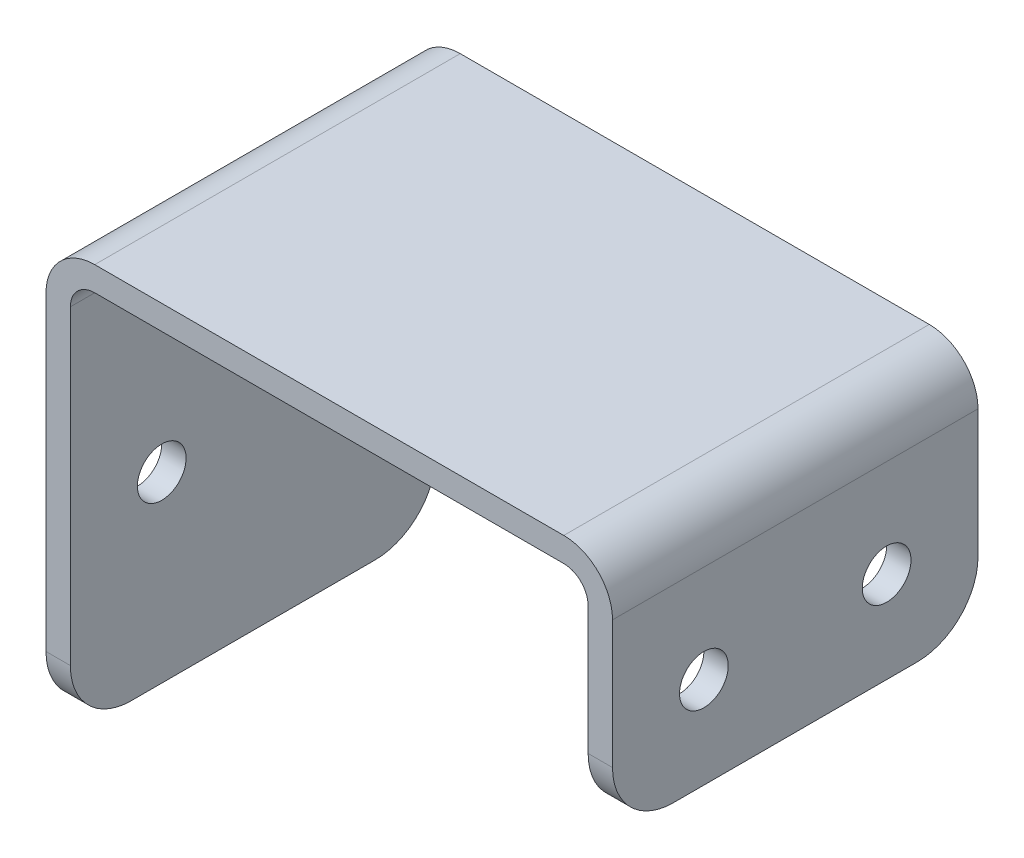
ISO-10303-21;
HEADER;
FILE_DESCRIPTION(('STEP AP214'),'2;1');
FILE_NAME('part.step','',(''),(''),'','','');
FILE_SCHEMA(('AUTOMOTIVE_DESIGN { 1 0 10303 214 1 1 1 1 }'));
ENDSEC;
DATA;
#1=APPLICATION_CONTEXT('core data for automotive mechanical design processes');
#2=APPLICATION_PROTOCOL_DEFINITION('international standard','automotive_design',2000,#1);
#3=PRODUCT_CONTEXT('',#1,'mechanical');
#4=PRODUCT('Part','Part','',(#3));
#5=PRODUCT_RELATED_PRODUCT_CATEGORY('part','',(#4));
#6=PRODUCT_DEFINITION_FORMATION('','',#4);
#7=PRODUCT_DEFINITION_CONTEXT('part definition',#1,'design');
#8=PRODUCT_DEFINITION('design','',#6,#7);
#9=PRODUCT_DEFINITION_SHAPE('','',#8);
#10=(LENGTH_UNIT() NAMED_UNIT(*) SI_UNIT(.MILLI.,.METRE.));
#11=(NAMED_UNIT(*) PLANE_ANGLE_UNIT() SI_UNIT($,.RADIAN.));
#12=(NAMED_UNIT(*) SI_UNIT($,.STERADIAN.) SOLID_ANGLE_UNIT());
#13=UNCERTAINTY_MEASURE_WITH_UNIT(LENGTH_MEASURE(1.E-05),#10,'distance_accuracy_value','');
#14=(GEOMETRIC_REPRESENTATION_CONTEXT(3) GLOBAL_UNCERTAINTY_ASSIGNED_CONTEXT((#13)) GLOBAL_UNIT_ASSIGNED_CONTEXT((#10,
#11,#12)) REPRESENTATION_CONTEXT('',''));
#15=CARTESIAN_POINT('',(0.,0.,0.));
#16=DIRECTION('',(0.,0.,1.));
#17=DIRECTION('',(1.,0.,0.));
#18=AXIS2_PLACEMENT_3D('',#15,#16,#17);
#19=CARTESIAN_POINT('',(-42.5,0.,60.));
#20=DIRECTION('',(0.,1.,0.));
#21=DIRECTION('',(-1.,0.,0.));
#22=AXIS2_PLACEMENT_3D('',#19,#20,#21);
#23=PLANE('',#22);
#24=DIRECTION('',(0.,0.,-1.));
#25=VECTOR('',#24,1.);
#26=CARTESIAN_POINT('',(-42.5,0.,60.));
#27=LINE('',#26,#25);
#28=CARTESIAN_POINT('',(-42.5,0.,50.));
#29=VERTEX_POINT('',#28);
#30=CARTESIAN_POINT('',(-42.5,0.,10.));
#31=VERTEX_POINT('',#30);
#32=EDGE_CURVE('E167',#29,#31,#27,.T.);
#33=ORIENTED_EDGE('',*,*,#32,.F.);
#34=DIRECTION('',(1.,0.,0.));
#35=VECTOR('',#34,1.);
#36=CARTESIAN_POINT('',(-42.5,0.,50.));
#37=LINE('',#36,#35);
#38=CARTESIAN_POINT('',(-46.5,0.,50.));
#39=VERTEX_POINT('',#38);
#40=EDGE_CURVE('E55',#29,#39,#37,.F.);
#41=ORIENTED_EDGE('',*,*,#40,.T.);
#42=DIRECTION('',(0.,0.,-1.));
#43=VECTOR('',#42,1.);
#44=CARTESIAN_POINT('',(-46.5,0.,60.));
#45=LINE('',#44,#43);
#46=CARTESIAN_POINT('',(-46.5,0.,10.));
#47=VERTEX_POINT('',#46);
#48=EDGE_CURVE('E192',#39,#47,#45,.T.);
#49=ORIENTED_EDGE('',*,*,#48,.T.);
#50=DIRECTION('',(1.,0.,0.));
#51=VECTOR('',#50,1.);
#52=CARTESIAN_POINT('',(-42.5,0.,10.));
#53=LINE('',#52,#51);
#54=EDGE_CURVE('E266',#47,#31,#53,.T.);
#55=ORIENTED_EDGE('',*,*,#54,.T.);
#56=EDGE_LOOP('',(#33,#41,#49,#55));
#57=FACE_BOUND('',#56,.T.);
#58=ADVANCED_FACE('F34',(#57),#23,.F.);
#59=CARTESIAN_POINT('',(-42.5,0.,60.));
#60=DIRECTION('',(-1.,0.,0.));
#61=DIRECTION('',(0.,-1.,0.));
#62=AXIS2_PLACEMENT_3D('',#59,#60,#61);
#63=PLANE('',#62);
#64=CARTESIAN_POINT('',(-42.5,30.,15.));
#65=DIRECTION('',(-1.,0.,0.));
#66=DIRECTION('',(0.,-1.,0.));
#67=AXIS2_PLACEMENT_3D('',#64,#65,#66);
#68=CIRCLE('',#67,4.);
#69=CARTESIAN_POINT('',(-42.5,26.,15.));
#70=VERTEX_POINT('',#69);
#71=EDGE_CURVE('E195',#70,#70,#68,.F.);
#72=ORIENTED_EDGE('',*,*,#71,.F.);
#73=EDGE_LOOP('',(#72));
#74=FACE_BOUND('',#73,.T.);
#75=CARTESIAN_POINT('',(-42.5,30.,45.));
#76=DIRECTION('',(-1.,0.,0.));
#77=DIRECTION('',(0.,-1.,0.));
#78=AXIS2_PLACEMENT_3D('',#75,#76,#77);
#79=CIRCLE('',#78,4.00000000000001);
#80=CARTESIAN_POINT('',(-42.5,26.,45.));
#81=VERTEX_POINT('',#80);
#82=EDGE_CURVE('E511',#81,#81,#79,.F.);
#83=ORIENTED_EDGE('',*,*,#82,.F.);
#84=EDGE_LOOP('',(#83));
#85=FACE_BOUND('',#84,.T.);
#86=DIRECTION('',(0.,1.,0.));
#87=VECTOR('',#86,1.);
#88=CARTESIAN_POINT('',(-42.5,0.,60.));
#89=LINE('',#88,#87);
#90=CARTESIAN_POINT('',(-42.5,9.99999999999999,60.));
#91=VERTEX_POINT('',#90);
#92=CARTESIAN_POINT('',(-42.5,61.,60.));
#93=VERTEX_POINT('',#92);
#94=EDGE_CURVE('E147',#91,#93,#89,.T.);
#95=ORIENTED_EDGE('',*,*,#94,.F.);
#96=CARTESIAN_POINT('',(-42.5,9.99999999999999,50.));
#97=DIRECTION('',(-1.,0.,0.));
#98=DIRECTION('',(0.,-1.,0.));
#99=AXIS2_PLACEMENT_3D('',#96,#97,#98);
#100=CIRCLE('',#99,10.);
#101=EDGE_CURVE('E264',#91,#29,#100,.F.);
#102=ORIENTED_EDGE('',*,*,#101,.T.);
#103=ORIENTED_EDGE('',*,*,#32,.T.);
#104=CARTESIAN_POINT('',(-42.5,10.,10.));
#105=DIRECTION('',(-1.,0.,0.));
#106=DIRECTION('',(0.,-1.,0.));
#107=AXIS2_PLACEMENT_3D('',#104,#105,#106);
#108=CIRCLE('',#107,10.);
#109=CARTESIAN_POINT('',(-42.5,9.99999999999999,0.));
#110=VERTEX_POINT('',#109);
#111=EDGE_CURVE('E262',#31,#110,#108,.F.);
#112=ORIENTED_EDGE('',*,*,#111,.T.);
#113=DIRECTION('',(0.,1.,0.));
#114=VECTOR('',#113,1.);
#115=CARTESIAN_POINT('',(-42.5,0.,0.));
#116=LINE('',#115,#114);
#117=CARTESIAN_POINT('',(-42.5,61.,0.));
#118=VERTEX_POINT('',#117);
#119=EDGE_CURVE('E164',#110,#118,#116,.T.);
#120=ORIENTED_EDGE('',*,*,#119,.T.);
#121=DIRECTION('',(0.,0.,-1.));
#122=VECTOR('',#121,1.);
#123=CARTESIAN_POINT('',(-42.5,61.,60.));
#124=LINE('',#123,#122);
#125=EDGE_CURVE('E161',#93,#118,#124,.T.);
#126=ORIENTED_EDGE('',*,*,#125,.F.);
#127=EDGE_LOOP('',(#95,#102,#103,#112,#120,#126));
#128=FACE_BOUND('',#127,.T.);
#129=ADVANCED_FACE('F162',(#74,#85,#128),#63,.F.);
#130=CARTESIAN_POINT('',(-38.5,61.,60.));
#131=DIRECTION('',(0.,0.,-1.));
#132=DIRECTION('',(-1.,0.,0.));
#133=AXIS2_PLACEMENT_3D('',#130,#131,#132);
#134=CYLINDRICAL_SURFACE('',#133,4.);
#135=CARTESIAN_POINT('',(-38.5,61.,0.));
#136=DIRECTION('',(0.,0.,-1.));
#137=DIRECTION('',(-1.,0.,0.));
#138=AXIS2_PLACEMENT_3D('',#135,#136,#137);
#139=CIRCLE('',#138,4.);
#140=CARTESIAN_POINT('',(-38.5,65.,0.));
#141=VERTEX_POINT('',#140);
#142=EDGE_CURVE('E194',#118,#141,#139,.T.);
#143=ORIENTED_EDGE('',*,*,#142,.T.);
#144=DIRECTION('',(0.,0.,-1.));
#145=VECTOR('',#144,1.);
#146=CARTESIAN_POINT('',(-38.5,65.,60.));
#147=LINE('',#146,#145);
#148=CARTESIAN_POINT('',(-38.5,65.,60.));
#149=VERTEX_POINT('',#148);
#150=EDGE_CURVE('E168',#149,#141,#147,.T.);
#151=ORIENTED_EDGE('',*,*,#150,.F.);
#152=CARTESIAN_POINT('',(-38.5,61.,60.));
#153=DIRECTION('',(0.,0.,-1.));
#154=DIRECTION('',(-1.,0.,0.));
#155=AXIS2_PLACEMENT_3D('',#152,#153,#154);
#156=CIRCLE('',#155,4.);
#157=EDGE_CURVE('E152',#93,#149,#156,.T.);
#158=ORIENTED_EDGE('',*,*,#157,.F.);
#159=ORIENTED_EDGE('',*,*,#125,.T.);
#160=EDGE_LOOP('',(#143,#151,#158,#159));
#161=FACE_BOUND('',#160,.T.);
#162=ADVANCED_FACE('F170',(#161),#134,.F.);
#163=CARTESIAN_POINT('',(-38.5,65.,60.));
#164=DIRECTION('',(0.,1.,0.));
#165=DIRECTION('',(0.,0.,1.));
#166=AXIS2_PLACEMENT_3D('',#163,#164,#165);
#167=PLANE('',#166);
#168=DIRECTION('',(1.,0.,0.));
#169=VECTOR('',#168,1.);
#170=CARTESIAN_POINT('',(-38.5,65.,0.));
#171=LINE('',#170,#169);
#172=CARTESIAN_POINT('',(38.5,65.,0.));
#173=VERTEX_POINT('',#172);
#174=EDGE_CURVE('E197',#141,#173,#171,.T.);
#175=ORIENTED_EDGE('',*,*,#174,.T.);
#176=DIRECTION('',(0.,0.,-1.));
#177=VECTOR('',#176,1.);
#178=CARTESIAN_POINT('',(38.5,65.,60.));
#179=LINE('',#178,#177);
#180=CARTESIAN_POINT('',(38.5,65.,60.));
#181=VERTEX_POINT('',#180);
#182=EDGE_CURVE('E235',#181,#173,#179,.T.);
#183=ORIENTED_EDGE('',*,*,#182,.F.);
#184=DIRECTION('',(1.,0.,0.));
#185=VECTOR('',#184,1.);
#186=CARTESIAN_POINT('',(-38.5,65.,60.));
#187=LINE('',#186,#185);
#188=EDGE_CURVE('E173',#149,#181,#187,.T.);
#189=ORIENTED_EDGE('',*,*,#188,.F.);
#190=ORIENTED_EDGE('',*,*,#150,.T.);
#191=EDGE_LOOP('',(#175,#183,#189,#190));
#192=FACE_BOUND('',#191,.T.);
#193=ADVANCED_FACE('F369',(#192),#167,.F.);
#194=CARTESIAN_POINT('',(38.5,61.,60.));
#195=DIRECTION('',(0.,0.,-1.));
#196=DIRECTION('',(-1.,0.,0.));
#197=AXIS2_PLACEMENT_3D('',#194,#195,#196);
#198=CYLINDRICAL_SURFACE('',#197,4.);
#199=CARTESIAN_POINT('',(38.5,61.,0.));
#200=DIRECTION('',(0.,0.,-1.));
#201=DIRECTION('',(-1.,0.,0.));
#202=AXIS2_PLACEMENT_3D('',#199,#200,#201);
#203=CIRCLE('',#202,4.);
#204=CARTESIAN_POINT('',(42.5,61.,0.));
#205=VERTEX_POINT('',#204);
#206=EDGE_CURVE('E199',#173,#205,#203,.T.);
#207=ORIENTED_EDGE('',*,*,#206,.T.);
#208=DIRECTION('',(0.,0.,-1.));
#209=VECTOR('',#208,1.);
#210=CARTESIAN_POINT('',(42.5,61.,60.));
#211=LINE('',#210,#209);
#212=CARTESIAN_POINT('',(42.5,61.,60.));
#213=VERTEX_POINT('',#212);
#214=EDGE_CURVE('E232',#213,#205,#211,.T.);
#215=ORIENTED_EDGE('',*,*,#214,.F.);
#216=CARTESIAN_POINT('',(38.5,61.,60.));
#217=DIRECTION('',(0.,0.,-1.));
#218=DIRECTION('',(-1.,0.,0.));
#219=AXIS2_PLACEMENT_3D('',#216,#217,#218);
#220=CIRCLE('',#219,4.);
#221=EDGE_CURVE('E175',#181,#213,#220,.T.);
#222=ORIENTED_EDGE('',*,*,#221,.F.);
#223=ORIENTED_EDGE('',*,*,#182,.T.);
#224=EDGE_LOOP('',(#207,#215,#222,#223));
#225=FACE_BOUND('',#224,.T.);
#226=ADVANCED_FACE('F329',(#225),#198,.F.);
#227=CARTESIAN_POINT('',(42.5,61.,60.));
#228=DIRECTION('',(1.,0.,0.));
#229=DIRECTION('',(0.,1.,0.));
#230=AXIS2_PLACEMENT_3D('',#227,#228,#229);
#231=PLANE('',#230);
#232=CARTESIAN_POINT('',(42.5,45.,45.));
#233=DIRECTION('',(1.,0.,0.));
#234=DIRECTION('',(0.,1.,0.));
#235=AXIS2_PLACEMENT_3D('',#232,#233,#234);
#236=CIRCLE('',#235,4.00000000000001);
#237=CARTESIAN_POINT('',(42.5,49.,45.));
#238=VERTEX_POINT('',#237);
#239=EDGE_CURVE('E512',#238,#238,#236,.F.);
#240=ORIENTED_EDGE('',*,*,#239,.F.);
#241=EDGE_LOOP('',(#240));
#242=FACE_BOUND('',#241,.T.);
#243=CARTESIAN_POINT('',(42.5,45.,15.));
#244=DIRECTION('',(1.,0.,0.));
#245=DIRECTION('',(0.,1.,0.));
#246=AXIS2_PLACEMENT_3D('',#243,#244,#245);
#247=CIRCLE('',#246,4.);
#248=CARTESIAN_POINT('',(42.5,49.,15.));
#249=VERTEX_POINT('',#248);
#250=EDGE_CURVE('E525',#249,#249,#247,.F.);
#251=ORIENTED_EDGE('',*,*,#250,.F.);
#252=EDGE_LOOP('',(#251));
#253=FACE_BOUND('',#252,.T.);
#254=DIRECTION('',(0.,-1.,0.));
#255=VECTOR('',#254,1.);
#256=CARTESIAN_POINT('',(42.5,61.,0.));
#257=LINE('',#256,#255);
#258=CARTESIAN_POINT('',(42.5,40.,0.));
#259=VERTEX_POINT('',#258);
#260=EDGE_CURVE('E201',#205,#259,#257,.T.);
#261=ORIENTED_EDGE('',*,*,#260,.T.);
#262=CARTESIAN_POINT('',(42.5,40.,10.));
#263=DIRECTION('',(1.,0.,0.));
#264=DIRECTION('',(0.,1.,0.));
#265=AXIS2_PLACEMENT_3D('',#262,#263,#264);
#266=CIRCLE('',#265,10.);
#267=CARTESIAN_POINT('',(42.5,30.,10.));
#268=VERTEX_POINT('',#267);
#269=EDGE_CURVE('E256',#259,#268,#266,.F.);
#270=ORIENTED_EDGE('',*,*,#269,.T.);
#271=DIRECTION('',(0.,0.,-1.));
#272=VECTOR('',#271,1.);
#273=CARTESIAN_POINT('',(42.5,30.,60.));
#274=LINE('',#273,#272);
#275=CARTESIAN_POINT('',(42.5,30.,50.));
#276=VERTEX_POINT('',#275);
#277=EDGE_CURVE('E229',#276,#268,#274,.T.);
#278=ORIENTED_EDGE('',*,*,#277,.F.);
#279=CARTESIAN_POINT('',(42.5,40.,50.));
#280=DIRECTION('',(1.,0.,0.));
#281=DIRECTION('',(0.,1.,0.));
#282=AXIS2_PLACEMENT_3D('',#279,#280,#281);
#283=CIRCLE('',#282,10.);
#284=CARTESIAN_POINT('',(42.5,40.,60.));
#285=VERTEX_POINT('',#284);
#286=EDGE_CURVE('E254',#276,#285,#283,.F.);
#287=ORIENTED_EDGE('',*,*,#286,.T.);
#288=DIRECTION('',(0.,-1.,0.));
#289=VECTOR('',#288,1.);
#290=CARTESIAN_POINT('',(42.5,61.,60.));
#291=LINE('',#290,#289);
#292=EDGE_CURVE('E180',#213,#285,#291,.T.);
#293=ORIENTED_EDGE('',*,*,#292,.F.);
#294=ORIENTED_EDGE('',*,*,#214,.T.);
#295=EDGE_LOOP('',(#261,#270,#278,#287,#293,#294));
#296=FACE_BOUND('',#295,.T.);
#297=ADVANCED_FACE('F323',(#242,#253,#296),#231,.F.);
#298=CARTESIAN_POINT('',(42.5,30.,60.));
#299=DIRECTION('',(0.,1.,0.));
#300=DIRECTION('',(0.,0.,1.));
#301=AXIS2_PLACEMENT_3D('',#298,#299,#300);
#302=PLANE('',#301);
#303=ORIENTED_EDGE('',*,*,#277,.T.);
#304=DIRECTION('',(1.,0.,0.));
#305=VECTOR('',#304,1.);
#306=CARTESIAN_POINT('',(46.5,30.,10.));
#307=LINE('',#306,#305);
#308=CARTESIAN_POINT('',(46.5,30.,10.));
#309=VERTEX_POINT('',#308);
#310=EDGE_CURVE('E243',#268,#309,#307,.T.);
#311=ORIENTED_EDGE('',*,*,#310,.T.);
#312=DIRECTION('',(0.,0.,-1.));
#313=VECTOR('',#312,1.);
#314=CARTESIAN_POINT('',(46.5,30.,60.));
#315=LINE('',#314,#313);
#316=CARTESIAN_POINT('',(46.5,30.,50.));
#317=VERTEX_POINT('',#316);
#318=EDGE_CURVE('E226',#317,#309,#315,.T.);
#319=ORIENTED_EDGE('',*,*,#318,.F.);
#320=DIRECTION('',(1.,0.,0.));
#321=VECTOR('',#320,1.);
#322=CARTESIAN_POINT('',(42.5,30.,50.));
#323=LINE('',#322,#321);
#324=EDGE_CURVE('E241',#317,#276,#323,.F.);
#325=ORIENTED_EDGE('',*,*,#324,.T.);
#326=EDGE_LOOP('',(#303,#311,#319,#325));
#327=FACE_BOUND('',#326,.T.);
#328=ADVANCED_FACE('F338',(#327),#302,.F.);
#329=CARTESIAN_POINT('',(46.5,61.,60.));
#330=DIRECTION('',(-1.,0.,0.));
#331=DIRECTION('',(0.,-1.,0.));
#332=AXIS2_PLACEMENT_3D('',#329,#330,#331);
#333=PLANE('',#332);
#334=CARTESIAN_POINT('',(46.5,45.,45.));
#335=DIRECTION('',(1.,0.,0.));
#336=DIRECTION('',(0.,1.,0.));
#337=AXIS2_PLACEMENT_3D('',#334,#335,#336);
#338=CIRCLE('',#337,4.00000000000001);
#339=CARTESIAN_POINT('',(46.5,49.,45.));
#340=VERTEX_POINT('',#339);
#341=EDGE_CURVE('E516',#340,#340,#338,.T.);
#342=ORIENTED_EDGE('',*,*,#341,.F.);
#343=EDGE_LOOP('',(#342));
#344=FACE_BOUND('',#343,.T.);
#345=CARTESIAN_POINT('',(46.5,45.,15.));
#346=DIRECTION('',(1.,0.,0.));
#347=DIRECTION('',(0.,1.,0.));
#348=AXIS2_PLACEMENT_3D('',#345,#346,#347);
#349=CIRCLE('',#348,4.);
#350=CARTESIAN_POINT('',(46.5,49.,15.));
#351=VERTEX_POINT('',#350);
#352=EDGE_CURVE('E522',#351,#351,#349,.T.);
#353=ORIENTED_EDGE('',*,*,#352,.F.);
#354=EDGE_LOOP('',(#353));
#355=FACE_BOUND('',#354,.T.);
#356=ORIENTED_EDGE('',*,*,#318,.T.);
#357=CARTESIAN_POINT('',(46.5,40.,10.));
#358=DIRECTION('',(-1.,0.,0.));
#359=DIRECTION('',(0.,-1.,0.));
#360=AXIS2_PLACEMENT_3D('',#357,#358,#359);
#361=CIRCLE('',#360,10.);
#362=CARTESIAN_POINT('',(46.5,40.,0.));
#363=VERTEX_POINT('',#362);
#364=EDGE_CURVE('E248',#309,#363,#361,.F.);
#365=ORIENTED_EDGE('',*,*,#364,.T.);
#366=DIRECTION('',(0.,1.,0.));
#367=VECTOR('',#366,1.);
#368=CARTESIAN_POINT('',(46.5,61.,0.));
#369=LINE('',#368,#367);
#370=CARTESIAN_POINT('',(46.5,61.,0.));
#371=VERTEX_POINT('',#370);
#372=EDGE_CURVE('E204',#363,#371,#369,.T.);
#373=ORIENTED_EDGE('',*,*,#372,.T.);
#374=DIRECTION('',(0.,0.,-1.));
#375=VECTOR('',#374,1.);
#376=CARTESIAN_POINT('',(46.5,61.,60.));
#377=LINE('',#376,#375);
#378=CARTESIAN_POINT('',(46.5,61.,60.));
#379=VERTEX_POINT('',#378);
#380=EDGE_CURVE('E223',#379,#371,#377,.T.);
#381=ORIENTED_EDGE('',*,*,#380,.F.);
#382=DIRECTION('',(0.,1.,0.));
#383=VECTOR('',#382,1.);
#384=CARTESIAN_POINT('',(46.5,61.,60.));
#385=LINE('',#384,#383);
#386=CARTESIAN_POINT('',(46.5,40.,60.));
#387=VERTEX_POINT('',#386);
#388=EDGE_CURVE('E182',#387,#379,#385,.T.);
#389=ORIENTED_EDGE('',*,*,#388,.F.);
#390=CARTESIAN_POINT('',(46.5,40.,50.));
#391=DIRECTION('',(-1.,0.,0.));
#392=DIRECTION('',(0.,-1.,0.));
#393=AXIS2_PLACEMENT_3D('',#390,#391,#392);
#394=CIRCLE('',#393,10.);
#395=EDGE_CURVE('E246',#387,#317,#394,.F.);
#396=ORIENTED_EDGE('',*,*,#395,.T.);
#397=EDGE_LOOP('',(#356,#365,#373,#381,#389,#396));
#398=FACE_BOUND('',#397,.T.);
#399=ADVANCED_FACE('F341',(#344,#355,#398),#333,.F.);
#400=CARTESIAN_POINT('',(38.5,61.,60.));
#401=DIRECTION('',(0.,0.,-1.));
#402=DIRECTION('',(-1.,0.,0.));
#403=AXIS2_PLACEMENT_3D('',#400,#401,#402);
#404=CYLINDRICAL_SURFACE('',#403,8.);
#405=CARTESIAN_POINT('',(38.5,61.,0.));
#406=DIRECTION('',(0.,0.,1.));
#407=DIRECTION('',(-1.,0.,0.));
#408=AXIS2_PLACEMENT_3D('',#405,#406,#407);
#409=CIRCLE('',#408,8.);
#410=CARTESIAN_POINT('',(38.5,69.,0.));
#411=VERTEX_POINT('',#410);
#412=EDGE_CURVE('E206',#371,#411,#409,.T.);
#413=ORIENTED_EDGE('',*,*,#412,.T.);
#414=DIRECTION('',(0.,0.,-1.));
#415=VECTOR('',#414,1.);
#416=CARTESIAN_POINT('',(38.5,69.,60.));
#417=LINE('',#416,#415);
#418=CARTESIAN_POINT('',(38.5,69.,60.));
#419=VERTEX_POINT('',#418);
#420=EDGE_CURVE('E220',#419,#411,#417,.T.);
#421=ORIENTED_EDGE('',*,*,#420,.F.);
#422=CARTESIAN_POINT('',(38.5,61.,60.));
#423=DIRECTION('',(0.,0.,1.));
#424=DIRECTION('',(-1.,0.,0.));
#425=AXIS2_PLACEMENT_3D('',#422,#423,#424);
#426=CIRCLE('',#425,8.);
#427=EDGE_CURVE('E184',#379,#419,#426,.T.);
#428=ORIENTED_EDGE('',*,*,#427,.F.);
#429=ORIENTED_EDGE('',*,*,#380,.T.);
#430=EDGE_LOOP('',(#413,#421,#428,#429));
#431=FACE_BOUND('',#430,.T.);
#432=ADVANCED_FACE('F346',(#431),#404,.T.);
#433=CARTESIAN_POINT('',(-38.5,69.,60.));
#434=DIRECTION('',(0.,-1.,0.));
#435=DIRECTION('',(0.,0.,-1.));
#436=AXIS2_PLACEMENT_3D('',#433,#434,#435);
#437=PLANE('',#436);
#438=DIRECTION('',(-1.,0.,0.));
#439=VECTOR('',#438,1.);
#440=CARTESIAN_POINT('',(-38.5,69.,0.));
#441=LINE('',#440,#439);
#442=CARTESIAN_POINT('',(-38.5,69.,0.));
#443=VERTEX_POINT('',#442);
#444=EDGE_CURVE('E208',#411,#443,#441,.T.);
#445=ORIENTED_EDGE('',*,*,#444,.T.);
#446=DIRECTION('',(0.,0.,-1.));
#447=VECTOR('',#446,1.);
#448=CARTESIAN_POINT('',(-38.5,69.,60.));
#449=LINE('',#448,#447);
#450=CARTESIAN_POINT('',(-38.5,69.,60.));
#451=VERTEX_POINT('',#450);
#452=EDGE_CURVE('E217',#451,#443,#449,.T.);
#453=ORIENTED_EDGE('',*,*,#452,.F.);
#454=DIRECTION('',(-1.,0.,0.));
#455=VECTOR('',#454,1.);
#456=CARTESIAN_POINT('',(-38.5,69.,60.));
#457=LINE('',#456,#455);
#458=EDGE_CURVE('E186',#419,#451,#457,.T.);
#459=ORIENTED_EDGE('',*,*,#458,.F.);
#460=ORIENTED_EDGE('',*,*,#420,.T.);
#461=EDGE_LOOP('',(#445,#453,#459,#460));
#462=FACE_BOUND('',#461,.T.);
#463=ADVANCED_FACE('F348',(#462),#437,.F.);
#464=CARTESIAN_POINT('',(-38.5,61.,60.));
#465=DIRECTION('',(0.,0.,-1.));
#466=DIRECTION('',(-1.,0.,0.));
#467=AXIS2_PLACEMENT_3D('',#464,#465,#466);
#468=CYLINDRICAL_SURFACE('',#467,8.);
#469=CARTESIAN_POINT('',(-38.5,61.,0.));
#470=DIRECTION('',(0.,0.,1.));
#471=DIRECTION('',(-1.,0.,0.));
#472=AXIS2_PLACEMENT_3D('',#469,#470,#471);
#473=CIRCLE('',#472,8.);
#474=CARTESIAN_POINT('',(-46.5,61.,0.));
#475=VERTEX_POINT('',#474);
#476=EDGE_CURVE('E210',#443,#475,#473,.T.);
#477=ORIENTED_EDGE('',*,*,#476,.T.);
#478=DIRECTION('',(0.,0.,-1.));
#479=VECTOR('',#478,1.);
#480=CARTESIAN_POINT('',(-46.5,61.,60.));
#481=LINE('',#480,#479);
#482=CARTESIAN_POINT('',(-46.5,61.,60.));
#483=VERTEX_POINT('',#482);
#484=EDGE_CURVE('E214',#483,#475,#481,.T.);
#485=ORIENTED_EDGE('',*,*,#484,.F.);
#486=CARTESIAN_POINT('',(-38.5,61.,60.));
#487=DIRECTION('',(0.,0.,1.));
#488=DIRECTION('',(-1.,0.,0.));
#489=AXIS2_PLACEMENT_3D('',#486,#487,#488);
#490=CIRCLE('',#489,8.);
#491=EDGE_CURVE('E188',#451,#483,#490,.T.);
#492=ORIENTED_EDGE('',*,*,#491,.F.);
#493=ORIENTED_EDGE('',*,*,#452,.T.);
#494=EDGE_LOOP('',(#477,#485,#492,#493));
#495=FACE_BOUND('',#494,.T.);
#496=ADVANCED_FACE('F281',(#495),#468,.T.);
#497=CARTESIAN_POINT('',(-46.5,0.,60.));
#498=DIRECTION('',(1.,0.,0.));
#499=DIRECTION('',(0.,1.,0.));
#500=AXIS2_PLACEMENT_3D('',#497,#498,#499);
#501=PLANE('',#500);
#502=CARTESIAN_POINT('',(-46.5,30.,15.));
#503=DIRECTION('',(-1.,0.,0.));
#504=DIRECTION('',(0.,-1.,0.));
#505=AXIS2_PLACEMENT_3D('',#502,#503,#504);
#506=CIRCLE('',#505,4.);
#507=CARTESIAN_POINT('',(-46.5,26.,15.));
#508=VERTEX_POINT('',#507);
#509=EDGE_CURVE('E507',#508,#508,#506,.T.);
#510=ORIENTED_EDGE('',*,*,#509,.F.);
#511=EDGE_LOOP('',(#510));
#512=FACE_BOUND('',#511,.T.);
#513=CARTESIAN_POINT('',(-46.5,30.,45.));
#514=DIRECTION('',(-1.,0.,0.));
#515=DIRECTION('',(0.,-1.,0.));
#516=AXIS2_PLACEMENT_3D('',#513,#514,#515);
#517=CIRCLE('',#516,4.00000000000001);
#518=CARTESIAN_POINT('',(-46.5,26.,45.));
#519=VERTEX_POINT('',#518);
#520=EDGE_CURVE('E510',#519,#519,#517,.T.);
#521=ORIENTED_EDGE('',*,*,#520,.F.);
#522=EDGE_LOOP('',(#521));
#523=FACE_BOUND('',#522,.T.);
#524=ORIENTED_EDGE('',*,*,#48,.F.);
#525=CARTESIAN_POINT('',(-46.5,10.,50.));
#526=DIRECTION('',(1.,0.,0.));
#527=DIRECTION('',(0.,1.,0.));
#528=AXIS2_PLACEMENT_3D('',#525,#526,#527);
#529=CIRCLE('',#528,10.);
#530=CARTESIAN_POINT('',(-46.5,9.99999999999999,60.));
#531=VERTEX_POINT('',#530);
#532=EDGE_CURVE('E11',#39,#531,#529,.F.);
#533=ORIENTED_EDGE('',*,*,#532,.T.);
#534=DIRECTION('',(0.,-1.,0.));
#535=VECTOR('',#534,1.);
#536=CARTESIAN_POINT('',(-46.5,0.,60.));
#537=LINE('',#536,#535);
#538=EDGE_CURVE('E190',#483,#531,#537,.T.);
#539=ORIENTED_EDGE('',*,*,#538,.F.);
#540=ORIENTED_EDGE('',*,*,#484,.T.);
#541=DIRECTION('',(0.,-1.,0.));
#542=VECTOR('',#541,1.);
#543=CARTESIAN_POINT('',(-46.5,0.,0.));
#544=LINE('',#543,#542);
#545=CARTESIAN_POINT('',(-46.5,10.,0.));
#546=VERTEX_POINT('',#545);
#547=EDGE_CURVE('E158',#475,#546,#544,.T.);
#548=ORIENTED_EDGE('',*,*,#547,.T.);
#549=CARTESIAN_POINT('',(-46.5,10.,10.));
#550=DIRECTION('',(1.,0.,0.));
#551=DIRECTION('',(0.,1.,0.));
#552=AXIS2_PLACEMENT_3D('',#549,#550,#551);
#553=CIRCLE('',#552,10.);
#554=EDGE_CURVE('E42',#546,#47,#553,.F.);
#555=ORIENTED_EDGE('',*,*,#554,.T.);
#556=EDGE_LOOP('',(#524,#533,#539,#540,#548,#555));
#557=FACE_BOUND('',#556,.T.);
#558=ADVANCED_FACE('F275',(#512,#523,#557),#501,.F.);
#559=CARTESIAN_POINT('',(-38.5,61.,60.));
#560=DIRECTION('',(0.,0.,-1.));
#561=DIRECTION('',(-1.,0.,0.));
#562=AXIS2_PLACEMENT_3D('',#559,#560,#561);
#563=PLANE('',#562);
#564=ORIENTED_EDGE('',*,*,#292,.T.);
#565=DIRECTION('',(1.,0.,0.));
#566=VECTOR('',#565,1.);
#567=CARTESIAN_POINT('',(-38.5,40.,60.));
#568=LINE('',#567,#566);
#569=EDGE_CURVE('E259',#285,#387,#568,.T.);
#570=ORIENTED_EDGE('',*,*,#569,.T.);
#571=ORIENTED_EDGE('',*,*,#388,.T.);
#572=ORIENTED_EDGE('',*,*,#427,.T.);
#573=ORIENTED_EDGE('',*,*,#458,.T.);
#574=ORIENTED_EDGE('',*,*,#491,.T.);
#575=ORIENTED_EDGE('',*,*,#538,.T.);
#576=DIRECTION('',(1.,0.,0.));
#577=VECTOR('',#576,1.);
#578=CARTESIAN_POINT('',(-38.5,9.99999999999999,60.));
#579=LINE('',#578,#577);
#580=EDGE_CURVE('E156',#531,#91,#579,.T.);
#581=ORIENTED_EDGE('',*,*,#580,.T.);
#582=ORIENTED_EDGE('',*,*,#94,.T.);
#583=ORIENTED_EDGE('',*,*,#157,.T.);
#584=ORIENTED_EDGE('',*,*,#188,.T.);
#585=ORIENTED_EDGE('',*,*,#221,.T.);
#586=EDGE_LOOP('',(#564,#570,#571,#572,#573,#574,#575,#581,#582,#583,#584,#585));
#587=FACE_BOUND('',#586,.T.);
#588=ADVANCED_FACE('F150',(#587),#563,.F.);
#589=CARTESIAN_POINT('',(-38.5,61.,0.));
#590=DIRECTION('',(0.,0.,-1.));
#591=DIRECTION('',(-1.,0.,0.));
#592=AXIS2_PLACEMENT_3D('',#589,#590,#591);
#593=PLANE('',#592);
#594=ORIENTED_EDGE('',*,*,#372,.F.);
#595=DIRECTION('',(1.,0.,0.));
#596=VECTOR('',#595,1.);
#597=CARTESIAN_POINT('',(42.5,40.,0.));
#598=LINE('',#597,#596);
#599=EDGE_CURVE('E252',#363,#259,#598,.F.);
#600=ORIENTED_EDGE('',*,*,#599,.T.);
#601=ORIENTED_EDGE('',*,*,#260,.F.);
#602=ORIENTED_EDGE('',*,*,#206,.F.);
#603=ORIENTED_EDGE('',*,*,#174,.F.);
#604=ORIENTED_EDGE('',*,*,#142,.F.);
#605=ORIENTED_EDGE('',*,*,#119,.F.);
#606=DIRECTION('',(1.,0.,0.));
#607=VECTOR('',#606,1.);
#608=CARTESIAN_POINT('',(-46.5,10.,0.));
#609=LINE('',#608,#607);
#610=EDGE_CURVE('E250',#110,#546,#609,.F.);
#611=ORIENTED_EDGE('',*,*,#610,.T.);
#612=ORIENTED_EDGE('',*,*,#547,.F.);
#613=ORIENTED_EDGE('',*,*,#476,.F.);
#614=ORIENTED_EDGE('',*,*,#444,.F.);
#615=ORIENTED_EDGE('',*,*,#412,.F.);
#616=EDGE_LOOP('',(#594,#600,#601,#602,#603,#604,#605,#611,#612,#613,#614,#615));
#617=FACE_BOUND('',#616,.T.);
#618=ADVANCED_FACE('F286',(#617),#593,.T.);
#619=CARTESIAN_POINT('',(46.501,30.,45.));
#620=DIRECTION('',(-1.,0.,0.));
#621=DIRECTION('',(0.,-1.,0.));
#622=AXIS2_PLACEMENT_3D('',#619,#620,#621);
#623=CYLINDRICAL_SURFACE('',#622,4.00000000000001);
#624=ORIENTED_EDGE('',*,*,#520,.T.);
#625=EDGE_LOOP('',(#624));
#626=FACE_BOUND('',#625,.T.);
#627=ORIENTED_EDGE('',*,*,#82,.T.);
#628=EDGE_LOOP('',(#627));
#629=FACE_BOUND('',#628,.T.);
#630=ADVANCED_FACE('F420',(#626,#629),#623,.F.);
#631=CARTESIAN_POINT('',(46.501,30.,15.));
#632=DIRECTION('',(-1.,0.,0.));
#633=DIRECTION('',(0.,-1.,0.));
#634=AXIS2_PLACEMENT_3D('',#631,#632,#633);
#635=CYLINDRICAL_SURFACE('',#634,4.);
#636=ORIENTED_EDGE('',*,*,#509,.T.);
#637=EDGE_LOOP('',(#636));
#638=FACE_BOUND('',#637,.T.);
#639=ORIENTED_EDGE('',*,*,#71,.T.);
#640=EDGE_LOOP('',(#639));
#641=FACE_BOUND('',#640,.T.);
#642=ADVANCED_FACE('F311',(#638,#641),#635,.F.);
#643=CARTESIAN_POINT('',(42.5,40.,10.));
#644=DIRECTION('',(-1.,0.,0.));
#645=DIRECTION('',(0.,0.,1.));
#646=AXIS2_PLACEMENT_3D('',#643,#644,#645);
#647=CYLINDRICAL_SURFACE('',#646,10.);
#648=ORIENTED_EDGE('',*,*,#269,.F.);
#649=ORIENTED_EDGE('',*,*,#599,.F.);
#650=ORIENTED_EDGE('',*,*,#364,.F.);
#651=ORIENTED_EDGE('',*,*,#310,.F.);
#652=EDGE_LOOP('',(#648,#649,#650,#651));
#653=FACE_BOUND('',#652,.T.);
#654=ADVANCED_FACE('F308',(#653),#647,.T.);
#655=CARTESIAN_POINT('',(-38.5,40.,50.));
#656=DIRECTION('',(1.,0.,0.));
#657=DIRECTION('',(0.,0.,-1.));
#658=AXIS2_PLACEMENT_3D('',#655,#656,#657);
#659=CYLINDRICAL_SURFACE('',#658,10.);
#660=ORIENTED_EDGE('',*,*,#286,.F.);
#661=ORIENTED_EDGE('',*,*,#324,.F.);
#662=ORIENTED_EDGE('',*,*,#395,.F.);
#663=ORIENTED_EDGE('',*,*,#569,.F.);
#664=EDGE_LOOP('',(#660,#661,#662,#663));
#665=FACE_BOUND('',#664,.T.);
#666=ADVANCED_FACE('F298',(#665),#659,.T.);
#667=CARTESIAN_POINT('',(-38.5,9.99999999999999,50.));
#668=DIRECTION('',(1.,0.,0.));
#669=DIRECTION('',(0.,1.,0.));
#670=AXIS2_PLACEMENT_3D('',#667,#668,#669);
#671=CYLINDRICAL_SURFACE('',#670,10.);
#672=ORIENTED_EDGE('',*,*,#532,.F.);
#673=ORIENTED_EDGE('',*,*,#40,.F.);
#674=ORIENTED_EDGE('',*,*,#101,.F.);
#675=ORIENTED_EDGE('',*,*,#580,.F.);
#676=EDGE_LOOP('',(#672,#673,#674,#675));
#677=FACE_BOUND('',#676,.T.);
#678=ADVANCED_FACE('F273',(#677),#671,.T.);
#679=CARTESIAN_POINT('',(-42.5,10.,10.));
#680=DIRECTION('',(-1.,0.,0.));
#681=DIRECTION('',(0.,-1.,0.));
#682=AXIS2_PLACEMENT_3D('',#679,#680,#681);
#683=CYLINDRICAL_SURFACE('',#682,10.);
#684=ORIENTED_EDGE('',*,*,#554,.F.);
#685=ORIENTED_EDGE('',*,*,#610,.F.);
#686=ORIENTED_EDGE('',*,*,#111,.F.);
#687=ORIENTED_EDGE('',*,*,#54,.F.);
#688=EDGE_LOOP('',(#684,#685,#686,#687));
#689=FACE_BOUND('',#688,.T.);
#690=ADVANCED_FACE('F36',(#689),#683,.T.);
#691=CARTESIAN_POINT('',(-46.501,45.,15.));
#692=DIRECTION('',(1.,0.,0.));
#693=DIRECTION('',(0.,1.,0.));
#694=AXIS2_PLACEMENT_3D('',#691,#692,#693);
#695=CYLINDRICAL_SURFACE('',#694,4.);
#696=ORIENTED_EDGE('',*,*,#352,.T.);
#697=EDGE_LOOP('',(#696));
#698=FACE_BOUND('',#697,.T.);
#699=ORIENTED_EDGE('',*,*,#250,.T.);
#700=EDGE_LOOP('',(#699));
#701=FACE_BOUND('',#700,.T.);
#702=ADVANCED_FACE('F290',(#698,#701),#695,.F.);
#703=CARTESIAN_POINT('',(-46.501,45.,45.));
#704=DIRECTION('',(1.,0.,0.));
#705=DIRECTION('',(0.,1.,0.));
#706=AXIS2_PLACEMENT_3D('',#703,#704,#705);
#707=CYLINDRICAL_SURFACE('',#706,4.00000000000001);
#708=ORIENTED_EDGE('',*,*,#341,.T.);
#709=EDGE_LOOP('',(#708));
#710=FACE_BOUND('',#709,.T.);
#711=ORIENTED_EDGE('',*,*,#239,.T.);
#712=EDGE_LOOP('',(#711));
#713=FACE_BOUND('',#712,.T.);
#714=ADVANCED_FACE('F295',(#710,#713),#707,.F.);
#715=CLOSED_SHELL('',(#58,#129,#162,#193,#226,#297,#328,#399,#432,#463,#496,#558,#588,#618,#630,
#642,#654,#666,#678,#690,#702,#714));
#716=MANIFOLD_SOLID_BREP('B2',#715);
#717=ADVANCED_BREP_SHAPE_REPRESENTATION('',(#18,#716),#14);
#718=SHAPE_DEFINITION_REPRESENTATION(#9,#717);
ENDSEC;
END-ISO-10303-21;
